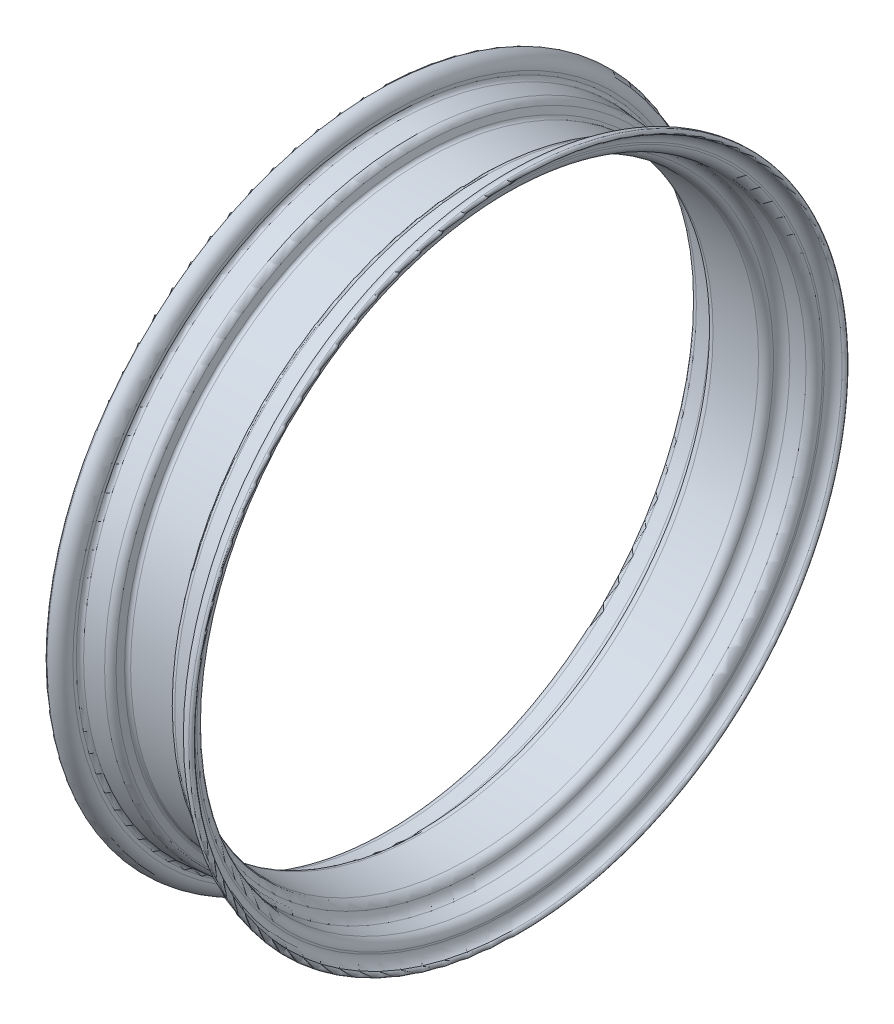
ISO-10303-21;
HEADER;
FILE_DESCRIPTION(('STEP AP214'),'2;1');
FILE_NAME('part.step','',(''),(''),'','','');
FILE_SCHEMA(('AUTOMOTIVE_DESIGN { 1 0 10303 214 1 1 1 1 }'));
ENDSEC;
DATA;
#1=APPLICATION_CONTEXT('core data for automotive mechanical design processes');
#2=APPLICATION_PROTOCOL_DEFINITION('international standard','automotive_design',2000,#1);
#3=PRODUCT_CONTEXT('',#1,'mechanical');
#4=PRODUCT('Part','Part','',(#3));
#5=PRODUCT_RELATED_PRODUCT_CATEGORY('part','',(#4));
#6=PRODUCT_DEFINITION_FORMATION('','',#4);
#7=PRODUCT_DEFINITION_CONTEXT('part definition',#1,'design');
#8=PRODUCT_DEFINITION('design','',#6,#7);
#9=PRODUCT_DEFINITION_SHAPE('','',#8);
#10=(LENGTH_UNIT() NAMED_UNIT(*) SI_UNIT(.MILLI.,.METRE.));
#11=(NAMED_UNIT(*) PLANE_ANGLE_UNIT() SI_UNIT($,.RADIAN.));
#12=(NAMED_UNIT(*) SI_UNIT($,.STERADIAN.) SOLID_ANGLE_UNIT());
#13=UNCERTAINTY_MEASURE_WITH_UNIT(LENGTH_MEASURE(1.E-05),#10,'distance_accuracy_value','');
#14=(GEOMETRIC_REPRESENTATION_CONTEXT(3) GLOBAL_UNCERTAINTY_ASSIGNED_CONTEXT((#13)) GLOBAL_UNIT_ASSIGNED_CONTEXT((#10,
#11,#12)) REPRESENTATION_CONTEXT('',''));
#15=CARTESIAN_POINT('',(0.,0.,0.));
#16=DIRECTION('',(0.,0.,1.));
#17=DIRECTION('',(1.,0.,0.));
#18=AXIS2_PLACEMENT_3D('',#15,#16,#17);
#19=CARTESIAN_POINT('',(-46.4999999999998,0.,0.));
#20=DIRECTION('',(-1.,0.,0.));
#21=DIRECTION('',(0.,0.,1.));
#22=AXIS2_PLACEMENT_3D('',#19,#20,#21);
#23=TOROIDAL_SURFACE('',#22,207.588294139001,8.49999999999985);
#24=CARTESIAN_POINT('',(-46.4999999999998,0.,0.));
#25=DIRECTION('',(-1.,0.,0.));
#26=DIRECTION('',(0.,0.,1.));
#27=AXIS2_PLACEMENT_3D('',#24,#25,#26);
#28=CIRCLE('',#27,216.088294139001);
#29=CARTESIAN_POINT('',(-46.4999999999998,0.,216.088294139001));
#30=VERTEX_POINT('',#29);
#31=EDGE_CURVE('E10',#30,#30,#28,.T.);
#32=ORIENTED_EDGE('',*,*,#31,.F.);
#33=EDGE_LOOP('',(#32));
#34=FACE_BOUND('',#33,.T.);
#35=CARTESIAN_POINT('',(-38.0000000000001,0.,0.));
#36=DIRECTION('',(-1.,0.,0.));
#37=DIRECTION('',(0.,0.,1.));
#38=AXIS2_PLACEMENT_3D('',#35,#36,#37);
#39=CIRCLE('',#38,207.588294139001);
#40=CARTESIAN_POINT('',(-38.0000000000001,0.,207.588294139001));
#41=VERTEX_POINT('',#40);
#42=EDGE_CURVE('E128',#41,#41,#39,.T.);
#43=ORIENTED_EDGE('',*,*,#42,.T.);
#44=EDGE_LOOP('',(#43));
#45=FACE_BOUND('',#44,.T.);
#46=ADVANCED_FACE('F34',(#34,#45),#23,.T.);
#47=CARTESIAN_POINT('',(-46.5000000000002,0.,0.));
#48=DIRECTION('',(-1.,0.,0.));
#49=DIRECTION('',(0.,0.,1.));
#50=AXIS2_PLACEMENT_3D('',#47,#48,#49);
#51=TOROIDAL_SURFACE('',#50,214.500794139001,1.58749999999996);
#52=CARTESIAN_POINT('',(-46.4999999999998,0.,0.));
#53=DIRECTION('',(-1.,0.,0.));
#54=DIRECTION('',(0.,0.,1.));
#55=AXIS2_PLACEMENT_3D('',#52,#53,#54);
#56=CIRCLE('',#55,212.913294139001);
#57=CARTESIAN_POINT('',(-46.4999999999998,0.,212.913294139001));
#58=VERTEX_POINT('',#57);
#59=EDGE_CURVE('E40',#58,#58,#56,.T.);
#60=ORIENTED_EDGE('',*,*,#59,.F.);
#61=EDGE_LOOP('',(#60));
#62=FACE_BOUND('',#61,.T.);
#63=ORIENTED_EDGE('',*,*,#31,.T.);
#64=EDGE_LOOP('',(#63));
#65=FACE_BOUND('',#64,.T.);
#66=ADVANCED_FACE('F297',(#62,#65),#51,.T.);
#67=CARTESIAN_POINT('',(-47.5664774784038,0.,0.));
#68=DIRECTION('',(-1.,0.,0.));
#69=DIRECTION('',(0.,0.,1.));
#70=AXIS2_PLACEMENT_3D('',#67,#68,#69);
#71=TOROIDAL_SURFACE('',#70,206.602777061292,6.4);
#72=CARTESIAN_POINT('',(-41.1664774784038,0.,0.));
#73=DIRECTION('',(-1.,0.,0.));
#74=DIRECTION('',(0.,0.,1.));
#75=AXIS2_PLACEMENT_3D('',#72,#73,#74);
#76=CIRCLE('',#75,206.602777061292);
#77=CARTESIAN_POINT('',(-41.1664774784038,0.,206.602777061292));
#78=VERTEX_POINT('',#77);
#79=EDGE_CURVE('E44',#78,#78,#76,.T.);
#80=ORIENTED_EDGE('',*,*,#79,.F.);
#81=EDGE_LOOP('',(#80));
#82=FACE_BOUND('',#81,.T.);
#83=ORIENTED_EDGE('',*,*,#59,.T.);
#84=EDGE_LOOP('',(#83));
#85=FACE_BOUND('',#84,.T.);
#86=ADVANCED_FACE('F292',(#82,#85),#71,.F.);
#87=CARTESIAN_POINT('',(-41.1664774784039,205.408377222496,0.));
#88=DIRECTION('',(1.,0.,0.));
#89=DIRECTION('',(0.,0.,-1.));
#90=AXIS2_PLACEMENT_3D('',#87,#88,#89);
#91=PLANE('',#90);
#92=CARTESIAN_POINT('',(-41.166477478404,0.,0.));
#93=DIRECTION('',(-1.,0.,0.));
#94=DIRECTION('',(0.,0.,1.));
#95=AXIS2_PLACEMENT_3D('',#92,#93,#94);
#96=CIRCLE('',#95,205.408377222496);
#97=CARTESIAN_POINT('',(-41.166477478404,0.,205.408377222496));
#98=VERTEX_POINT('',#97);
#99=EDGE_CURVE('E48',#98,#98,#96,.T.);
#100=ORIENTED_EDGE('',*,*,#99,.F.);
#101=EDGE_LOOP('',(#100));
#102=FACE_BOUND('',#101,.T.);
#103=ORIENTED_EDGE('',*,*,#79,.T.);
#104=EDGE_LOOP('',(#103));
#105=FACE_BOUND('',#104,.T.);
#106=ADVANCED_FACE('F286',(#102,#105),#91,.F.);
#107=CARTESIAN_POINT('',(-35.4797633166288,0.,0.));
#108=DIRECTION('',(-1.,0.,0.));
#109=DIRECTION('',(0.,0.,1.));
#110=AXIS2_PLACEMENT_3D('',#107,#108,#109);
#111=TOROIDAL_SURFACE('',#110,205.408377222496,5.68671416177523);
#112=CARTESIAN_POINT('',(-35.9753931131919,0.,0.));
#113=DIRECTION('',(-1.,0.,0.));
#114=DIRECTION('',(0.,0.,1.));
#115=AXIS2_PLACEMENT_3D('',#112,#113,#114);
#116=CIRCLE('',#115,199.743302724972);
#117=CARTESIAN_POINT('',(-35.9753931131919,0.,199.743302724972));
#118=VERTEX_POINT('',#117);
#119=EDGE_CURVE('E53',#118,#118,#116,.T.);
#120=ORIENTED_EDGE('',*,*,#119,.F.);
#121=EDGE_LOOP('',(#120));
#122=FACE_BOUND('',#121,.T.);
#123=ORIENTED_EDGE('',*,*,#99,.T.);
#124=EDGE_LOOP('',(#123));
#125=FACE_BOUND('',#124,.T.);
#126=ADVANCED_FACE('F280',(#122,#125),#111,.T.);
#127=CARTESIAN_POINT('',(-35.9753931131919,0.,0.));
#128=DIRECTION('',(-1.,0.,0.));
#129=DIRECTION('',(0.,0.,1.));
#130=AXIS2_PLACEMENT_3D('',#127,#128,#129);
#131=CONICAL_SURFACE('',#130,199.743302724972,0.0872664625997016);
#132=CARTESIAN_POINT('',(-26.1935720396754,0.,0.));
#133=DIRECTION('',(-1.,0.,0.));
#134=DIRECTION('',(0.,0.,1.));
#135=AXIS2_PLACEMENT_3D('',#132,#133,#134);
#136=CIRCLE('',#135,198.887504272401);
#137=CARTESIAN_POINT('',(-26.1935720396754,0.,198.887504272401));
#138=VERTEX_POINT('',#137);
#139=EDGE_CURVE('E56',#138,#138,#136,.T.);
#140=ORIENTED_EDGE('',*,*,#139,.F.);
#141=EDGE_LOOP('',(#140));
#142=FACE_BOUND('',#141,.T.);
#143=ORIENTED_EDGE('',*,*,#119,.T.);
#144=EDGE_LOOP('',(#143));
#145=FACE_BOUND('',#144,.T.);
#146=ADVANCED_FACE('F274',(#142,#145),#131,.F.);
#147=CARTESIAN_POINT('',(-26.7600843675352,0.,0.));
#148=DIRECTION('',(-1.,0.,0.));
#149=DIRECTION('',(0.,0.,1.));
#150=AXIS2_PLACEMENT_3D('',#147,#148,#149);
#151=TOROIDAL_SURFACE('',#150,192.412238734804,6.49999999999996);
#152=CARTESIAN_POINT('',(-20.4442449637123,0.,0.));
#153=DIRECTION('',(-1.,0.,0.));
#154=DIRECTION('',(0.,0.,1.));
#155=AXIS2_PLACEMENT_3D('',#152,#153,#154);
#156=CIRCLE('',#155,193.948524068042);
#157=CARTESIAN_POINT('',(-20.4442449637123,0.,193.948524068042));
#158=VERTEX_POINT('',#157);
#159=EDGE_CURVE('E59',#158,#158,#156,.T.);
#160=ORIENTED_EDGE('',*,*,#159,.F.);
#161=EDGE_LOOP('',(#160));
#162=FACE_BOUND('',#161,.T.);
#163=ORIENTED_EDGE('',*,*,#139,.T.);
#164=EDGE_LOOP('',(#163));
#165=FACE_BOUND('',#164,.T.);
#166=ADVANCED_FACE('F268',(#162,#165),#151,.F.);
#167=CARTESIAN_POINT('',(-14.9300313303746,0.,0.));
#168=DIRECTION('',(-1.,0.,0.));
#169=DIRECTION('',(0.,0.,1.));
#170=AXIS2_PLACEMENT_3D('',#167,#168,#169);
#171=TOROIDAL_SURFACE('',#170,195.289819339754,5.67500000000028);
#172=CARTESIAN_POINT('',(-14.9300313303755,0.,0.));
#173=DIRECTION('',(-1.,0.,0.));
#174=DIRECTION('',(0.,0.,1.));
#175=AXIS2_PLACEMENT_3D('',#172,#173,#174);
#176=CIRCLE('',#175,189.614819339754);
#177=CARTESIAN_POINT('',(-14.9300313303755,0.,189.614819339754));
#178=VERTEX_POINT('',#177);
#179=EDGE_CURVE('E62',#178,#178,#176,.T.);
#180=ORIENTED_EDGE('',*,*,#179,.F.);
#181=EDGE_LOOP('',(#180));
#182=FACE_BOUND('',#181,.T.);
#183=ORIENTED_EDGE('',*,*,#159,.T.);
#184=EDGE_LOOP('',(#183));
#185=FACE_BOUND('',#184,.T.);
#186=ADVANCED_FACE('F262',(#182,#185),#171,.T.);
#187=CARTESIAN_POINT('',(-85.5091699941872,0.,0.));
#188=DIRECTION('',(-1.,0.,0.));
#189=DIRECTION('',(0.,0.,1.));
#190=AXIS2_PLACEMENT_3D('',#187,#188,#189);
#191=CYLINDRICAL_SURFACE('',#190,189.614819339754);
#192=CARTESIAN_POINT('',(14.9300313303753,0.,0.));
#193=DIRECTION('',(-1.,0.,0.));
#194=DIRECTION('',(0.,0.,1.));
#195=AXIS2_PLACEMENT_3D('',#192,#193,#194);
#196=CIRCLE('',#195,189.614819339754);
#197=CARTESIAN_POINT('',(14.9300313303753,0.,189.614819339754));
#198=VERTEX_POINT('',#197);
#199=EDGE_CURVE('E65',#198,#198,#196,.T.);
#200=ORIENTED_EDGE('',*,*,#199,.F.);
#201=EDGE_LOOP('',(#200));
#202=FACE_BOUND('',#201,.T.);
#203=ORIENTED_EDGE('',*,*,#179,.T.);
#204=EDGE_LOOP('',(#203));
#205=FACE_BOUND('',#204,.T.);
#206=ADVANCED_FACE('F256',(#202,#205),#191,.F.);
#207=CARTESIAN_POINT('',(14.9300313303752,0.,0.));
#208=DIRECTION('',(-1.,0.,0.));
#209=DIRECTION('',(0.,0.,1.));
#210=AXIS2_PLACEMENT_3D('',#207,#208,#209);
#211=TOROIDAL_SURFACE('',#210,195.289819339754,5.67500000000001);
#212=CARTESIAN_POINT('',(20.4442449637126,0.,0.));
#213=DIRECTION('',(-1.,0.,0.));
#214=DIRECTION('',(0.,0.,1.));
#215=AXIS2_PLACEMENT_3D('',#212,#213,#214);
#216=CIRCLE('',#215,193.948524068042);
#217=CARTESIAN_POINT('',(20.4442449637126,0.,193.948524068042));
#218=VERTEX_POINT('',#217);
#219=EDGE_CURVE('E68',#218,#218,#216,.T.);
#220=ORIENTED_EDGE('',*,*,#219,.F.);
#221=EDGE_LOOP('',(#220));
#222=FACE_BOUND('',#221,.T.);
#223=ORIENTED_EDGE('',*,*,#199,.T.);
#224=EDGE_LOOP('',(#223));
#225=FACE_BOUND('',#224,.T.);
#226=ADVANCED_FACE('F250',(#222,#225),#211,.T.);
#227=CARTESIAN_POINT('',(26.7600843675352,0.,0.));
#228=DIRECTION('',(-1.,0.,0.));
#229=DIRECTION('',(0.,0.,1.));
#230=AXIS2_PLACEMENT_3D('',#227,#228,#229);
#231=TOROIDAL_SURFACE('',#230,192.412238734804,6.49999999999999);
#232=CARTESIAN_POINT('',(26.1935720396755,0.,0.));
#233=DIRECTION('',(-1.,0.,0.));
#234=DIRECTION('',(0.,0.,1.));
#235=AXIS2_PLACEMENT_3D('',#232,#233,#234);
#236=CIRCLE('',#235,198.887504272401);
#237=CARTESIAN_POINT('',(26.1935720396755,0.,198.887504272401));
#238=VERTEX_POINT('',#237);
#239=EDGE_CURVE('E71',#238,#238,#236,.T.);
#240=ORIENTED_EDGE('',*,*,#239,.F.);
#241=EDGE_LOOP('',(#240));
#242=FACE_BOUND('',#241,.T.);
#243=ORIENTED_EDGE('',*,*,#219,.T.);
#244=EDGE_LOOP('',(#243));
#245=FACE_BOUND('',#244,.T.);
#246=ADVANCED_FACE('F244',(#242,#245),#231,.F.);
#247=CARTESIAN_POINT('',(26.1935720396755,0.,0.));
#248=DIRECTION('',(1.,0.,0.));
#249=DIRECTION('',(0.,0.,-1.));
#250=AXIS2_PLACEMENT_3D('',#247,#248,#249);
#251=CONICAL_SURFACE('',#250,198.887504272401,0.087266462599705);
#252=CARTESIAN_POINT('',(35.9753931131919,0.,0.));
#253=DIRECTION('',(-1.,0.,0.));
#254=DIRECTION('',(0.,0.,1.));
#255=AXIS2_PLACEMENT_3D('',#252,#253,#254);
#256=CIRCLE('',#255,199.743302724972);
#257=CARTESIAN_POINT('',(35.9753931131919,0.,199.743302724972));
#258=VERTEX_POINT('',#257);
#259=EDGE_CURVE('E74',#258,#258,#256,.T.);
#260=ORIENTED_EDGE('',*,*,#259,.F.);
#261=EDGE_LOOP('',(#260));
#262=FACE_BOUND('',#261,.T.);
#263=ORIENTED_EDGE('',*,*,#239,.T.);
#264=EDGE_LOOP('',(#263));
#265=FACE_BOUND('',#264,.T.);
#266=ADVANCED_FACE('F238',(#262,#265),#251,.F.);
#267=CARTESIAN_POINT('',(35.4797633166288,0.,0.));
#268=DIRECTION('',(-1.,0.,0.));
#269=DIRECTION('',(0.,0.,1.));
#270=AXIS2_PLACEMENT_3D('',#267,#268,#269);
#271=TOROIDAL_SURFACE('',#270,205.408377222496,5.68671416177506);
#272=CARTESIAN_POINT('',(41.1664774784038,0.,0.));
#273=DIRECTION('',(-1.,0.,0.));
#274=DIRECTION('',(0.,0.,1.));
#275=AXIS2_PLACEMENT_3D('',#272,#273,#274);
#276=CIRCLE('',#275,205.408377222496);
#277=CARTESIAN_POINT('',(41.1664774784038,0.,205.408377222496));
#278=VERTEX_POINT('',#277);
#279=EDGE_CURVE('E77',#278,#278,#276,.T.);
#280=ORIENTED_EDGE('',*,*,#279,.F.);
#281=EDGE_LOOP('',(#280));
#282=FACE_BOUND('',#281,.T.);
#283=ORIENTED_EDGE('',*,*,#259,.T.);
#284=EDGE_LOOP('',(#283));
#285=FACE_BOUND('',#284,.T.);
#286=ADVANCED_FACE('F232',(#282,#285),#271,.T.);
#287=CARTESIAN_POINT('',(41.1664774784038,205.408377222496,0.));
#288=DIRECTION('',(-1.,0.,0.));
#289=DIRECTION('',(0.,0.,1.));
#290=AXIS2_PLACEMENT_3D('',#287,#288,#289);
#291=PLANE('',#290);
#292=CARTESIAN_POINT('',(41.1664774784038,0.,0.));
#293=DIRECTION('',(-1.,0.,0.));
#294=DIRECTION('',(0.,0.,1.));
#295=AXIS2_PLACEMENT_3D('',#292,#293,#294);
#296=CIRCLE('',#295,206.602777061292);
#297=CARTESIAN_POINT('',(41.1664774784038,0.,206.602777061292));
#298=VERTEX_POINT('',#297);
#299=EDGE_CURVE('E80',#298,#298,#296,.T.);
#300=ORIENTED_EDGE('',*,*,#299,.F.);
#301=EDGE_LOOP('',(#300));
#302=FACE_BOUND('',#301,.T.);
#303=ORIENTED_EDGE('',*,*,#279,.T.);
#304=EDGE_LOOP('',(#303));
#305=FACE_BOUND('',#304,.T.);
#306=ADVANCED_FACE('F226',(#302,#305),#291,.F.);
#307=CARTESIAN_POINT('',(47.5664774784038,0.,0.));
#308=DIRECTION('',(-1.,0.,0.));
#309=DIRECTION('',(0.,0.,1.));
#310=AXIS2_PLACEMENT_3D('',#307,#308,#309);
#311=TOROIDAL_SURFACE('',#310,206.602777061292,6.4);
#312=CARTESIAN_POINT('',(46.4999999999998,0.,0.));
#313=DIRECTION('',(-1.,0.,0.));
#314=DIRECTION('',(0.,0.,1.));
#315=AXIS2_PLACEMENT_3D('',#312,#313,#314);
#316=CIRCLE('',#315,212.913294139001);
#317=CARTESIAN_POINT('',(46.4999999999998,0.,212.913294139001));
#318=VERTEX_POINT('',#317);
#319=EDGE_CURVE('E83',#318,#318,#316,.T.);
#320=ORIENTED_EDGE('',*,*,#319,.F.);
#321=EDGE_LOOP('',(#320));
#322=FACE_BOUND('',#321,.T.);
#323=ORIENTED_EDGE('',*,*,#299,.T.);
#324=EDGE_LOOP('',(#323));
#325=FACE_BOUND('',#324,.T.);
#326=ADVANCED_FACE('F220',(#322,#325),#311,.F.);
#327=CARTESIAN_POINT('',(46.5000000000002,0.,0.));
#328=DIRECTION('',(-1.,0.,0.));
#329=DIRECTION('',(0.,0.,1.));
#330=AXIS2_PLACEMENT_3D('',#327,#328,#329);
#331=TOROIDAL_SURFACE('',#330,214.500794139001,1.58749999999994);
#332=CARTESIAN_POINT('',(46.4999999999998,0.,0.));
#333=DIRECTION('',(-1.,0.,0.));
#334=DIRECTION('',(0.,0.,1.));
#335=AXIS2_PLACEMENT_3D('',#332,#333,#334);
#336=CIRCLE('',#335,216.088294139001);
#337=CARTESIAN_POINT('',(46.4999999999998,0.,216.088294139001));
#338=VERTEX_POINT('',#337);
#339=EDGE_CURVE('E86',#338,#338,#336,.T.);
#340=ORIENTED_EDGE('',*,*,#339,.F.);
#341=EDGE_LOOP('',(#340));
#342=FACE_BOUND('',#341,.T.);
#343=ORIENTED_EDGE('',*,*,#319,.T.);
#344=EDGE_LOOP('',(#343));
#345=FACE_BOUND('',#344,.T.);
#346=ADVANCED_FACE('F214',(#342,#345),#331,.T.);
#347=CARTESIAN_POINT('',(46.4999999999998,0.,0.));
#348=DIRECTION('',(-1.,0.,0.));
#349=DIRECTION('',(0.,0.,1.));
#350=AXIS2_PLACEMENT_3D('',#347,#348,#349);
#351=TOROIDAL_SURFACE('',#350,207.588294139001,8.49999999999978);
#352=CARTESIAN_POINT('',(38.0000000000002,0.,0.));
#353=DIRECTION('',(-1.,0.,0.));
#354=DIRECTION('',(0.,0.,1.));
#355=AXIS2_PLACEMENT_3D('',#352,#353,#354);
#356=CIRCLE('',#355,207.588294139001);
#357=CARTESIAN_POINT('',(38.0000000000002,0.,207.588294139001));
#358=VERTEX_POINT('',#357);
#359=EDGE_CURVE('E89',#358,#358,#356,.T.);
#360=ORIENTED_EDGE('',*,*,#359,.F.);
#361=EDGE_LOOP('',(#360));
#362=FACE_BOUND('',#361,.T.);
#363=ORIENTED_EDGE('',*,*,#339,.T.);
#364=EDGE_LOOP('',(#363));
#365=FACE_BOUND('',#364,.T.);
#366=ADVANCED_FACE('F208',(#362,#365),#351,.T.);
#367=CARTESIAN_POINT('',(38.0000000000001,205.390486745229,0.));
#368=DIRECTION('',(1.,0.,0.));
#369=DIRECTION('',(0.,0.,-1.));
#370=AXIS2_PLACEMENT_3D('',#367,#368,#369);
#371=PLANE('',#370);
#372=CARTESIAN_POINT('',(38.,0.,0.));
#373=DIRECTION('',(-1.,0.,0.));
#374=DIRECTION('',(0.,0.,1.));
#375=AXIS2_PLACEMENT_3D('',#372,#373,#374);
#376=CIRCLE('',#375,205.390486745229);
#377=CARTESIAN_POINT('',(38.,0.,205.390486745229));
#378=VERTEX_POINT('',#377);
#379=EDGE_CURVE('E92',#378,#378,#376,.T.);
#380=ORIENTED_EDGE('',*,*,#379,.F.);
#381=EDGE_LOOP('',(#380));
#382=FACE_BOUND('',#381,.T.);
#383=ORIENTED_EDGE('',*,*,#359,.T.);
#384=EDGE_LOOP('',(#383));
#385=FACE_BOUND('',#384,.T.);
#386=ADVANCED_FACE('F202',(#382,#385),#371,.F.);
#387=CARTESIAN_POINT('',(35.5,0.,0.));
#388=DIRECTION('',(-1.,0.,0.));
#389=DIRECTION('',(0.,0.,1.));
#390=AXIS2_PLACEMENT_3D('',#387,#388,#389);
#391=TOROIDAL_SURFACE('',#390,205.390486745229,2.5);
#392=CARTESIAN_POINT('',(35.7178893568692,0.,0.));
#393=DIRECTION('',(-1.,0.,0.));
#394=DIRECTION('',(0.,0.,1.));
#395=AXIS2_PLACEMENT_3D('',#392,#393,#394);
#396=CIRCLE('',#395,202.9);
#397=CARTESIAN_POINT('',(35.7178893568692,0.,202.9));
#398=VERTEX_POINT('',#397);
#399=EDGE_CURVE('E95',#398,#398,#396,.T.);
#400=ORIENTED_EDGE('',*,*,#399,.F.);
#401=EDGE_LOOP('',(#400));
#402=FACE_BOUND('',#401,.T.);
#403=ORIENTED_EDGE('',*,*,#379,.T.);
#404=EDGE_LOOP('',(#403));
#405=FACE_BOUND('',#404,.T.);
#406=ADVANCED_FACE('F196',(#402,#405),#391,.F.);
#407=CARTESIAN_POINT('',(35.7178893568692,0.,0.));
#408=DIRECTION('',(1.,0.,0.));
#409=DIRECTION('',(0.,0.,-1.));
#410=AXIS2_PLACEMENT_3D('',#407,#408,#409);
#411=CONICAL_SURFACE('',#410,202.9,0.0872664625997016);
#412=CARTESIAN_POINT('',(23.0284663447406,0.,0.));
#413=DIRECTION('',(-1.,0.,0.));
#414=DIRECTION('',(0.,0.,1.));
#415=AXIS2_PLACEMENT_3D('',#412,#413,#414);
#416=CIRCLE('',#415,201.789819339754);
#417=CARTESIAN_POINT('',(23.0284663447406,0.,201.789819339754));
#418=VERTEX_POINT('',#417);
#419=EDGE_CURVE('E98',#418,#418,#416,.T.);
#420=ORIENTED_EDGE('',*,*,#419,.F.);
#421=EDGE_LOOP('',(#420));
#422=FACE_BOUND('',#421,.T.);
#423=ORIENTED_EDGE('',*,*,#399,.T.);
#424=EDGE_LOOP('',(#423));
#425=FACE_BOUND('',#424,.T.);
#426=ADVANCED_FACE('F190',(#422,#425),#411,.T.);
#427=CARTESIAN_POINT('',(23.4642450584789,0.,0.));
#428=DIRECTION('',(-1.,0.,0.));
#429=DIRECTION('',(0.,0.,1.));
#430=AXIS2_PLACEMENT_3D('',#427,#428,#429);
#431=TOROIDAL_SURFACE('',#430,196.808845849295,5.00000000000003);
#432=CARTESIAN_POINT('',(18.7657819545493,0.,0.));
#433=DIRECTION('',(-1.,0.,0.));
#434=DIRECTION('',(0.,0.,1.));
#435=AXIS2_PLACEMENT_3D('',#432,#433,#434);
#436=CIRCLE('',#435,198.518946565923);
#437=CARTESIAN_POINT('',(18.7657819545493,0.,198.518946565923));
#438=VERTEX_POINT('',#437);
#439=EDGE_CURVE('E101',#438,#438,#436,.T.);
#440=ORIENTED_EDGE('',*,*,#439,.F.);
#441=EDGE_LOOP('',(#440));
#442=FACE_BOUND('',#441,.T.);
#443=ORIENTED_EDGE('',*,*,#419,.T.);
#444=EDGE_LOOP('',(#443));
#445=FACE_BOUND('',#444,.T.);
#446=ADVANCED_FACE('F184',(#442,#445),#431,.T.);
#447=CARTESIAN_POINT('',(18.7657819545493,0.,0.));
#448=DIRECTION('',(1.,0.,0.));
#449=DIRECTION('',(0.,0.,-1.));
#450=AXIS2_PLACEMENT_3D('',#447,#448,#449);
#451=CONICAL_SURFACE('',#450,198.518946565923,1.22173047639603);
#452=CARTESIAN_POINT('',(17.27926288234,0.,0.));
#453=DIRECTION('',(-1.,0.,0.));
#454=DIRECTION('',(0.,0.,1.));
#455=AXIS2_PLACEMENT_3D('',#452,#453,#454);
#456=CIRCLE('',#455,194.43476898144);
#457=CARTESIAN_POINT('',(17.27926288234,0.,194.43476898144));
#458=VERTEX_POINT('',#457);
#459=EDGE_CURVE('E104',#458,#458,#456,.T.);
#460=ORIENTED_EDGE('',*,*,#459,.F.);
#461=EDGE_LOOP('',(#460));
#462=FACE_BOUND('',#461,.T.);
#463=ORIENTED_EDGE('',*,*,#439,.T.);
#464=EDGE_LOOP('',(#463));
#465=FACE_BOUND('',#464,.T.);
#466=ADVANCED_FACE('F178',(#462,#465),#451,.T.);
#467=CARTESIAN_POINT('',(14.9300313303752,0.,0.));
#468=DIRECTION('',(-1.,0.,0.));
#469=DIRECTION('',(0.,0.,1.));
#470=AXIS2_PLACEMENT_3D('',#467,#468,#469);
#471=TOROIDAL_SURFACE('',#470,195.289819339754,2.50000000000001);
#472=CARTESIAN_POINT('',(14.9300313303752,0.,0.));
#473=DIRECTION('',(-1.,0.,0.));
#474=DIRECTION('',(0.,0.,1.));
#475=AXIS2_PLACEMENT_3D('',#472,#473,#474);
#476=CIRCLE('',#475,192.789819339754);
#477=CARTESIAN_POINT('',(14.9300313303752,0.,192.789819339754));
#478=VERTEX_POINT('',#477);
#479=EDGE_CURVE('E107',#478,#478,#476,.T.);
#480=ORIENTED_EDGE('',*,*,#479,.F.);
#481=EDGE_LOOP('',(#480));
#482=FACE_BOUND('',#481,.T.);
#483=ORIENTED_EDGE('',*,*,#459,.T.);
#484=EDGE_LOOP('',(#483));
#485=FACE_BOUND('',#484,.T.);
#486=ADVANCED_FACE('F172',(#482,#485),#471,.F.);
#487=CARTESIAN_POINT('',(-85.5091699941872,0.,0.));
#488=DIRECTION('',(-1.,0.,0.));
#489=DIRECTION('',(0.,0.,1.));
#490=AXIS2_PLACEMENT_3D('',#487,#488,#489);
#491=CYLINDRICAL_SURFACE('',#490,192.789819339754);
#492=CARTESIAN_POINT('',(-14.930031330375,0.,0.));
#493=DIRECTION('',(-1.,0.,0.));
#494=DIRECTION('',(0.,0.,1.));
#495=AXIS2_PLACEMENT_3D('',#492,#493,#494);
#496=CIRCLE('',#495,192.789819339754);
#497=CARTESIAN_POINT('',(-14.930031330375,0.,192.789819339754));
#498=VERTEX_POINT('',#497);
#499=EDGE_CURVE('E110',#498,#498,#496,.T.);
#500=ORIENTED_EDGE('',*,*,#499,.F.);
#501=EDGE_LOOP('',(#500));
#502=FACE_BOUND('',#501,.T.);
#503=ORIENTED_EDGE('',*,*,#479,.T.);
#504=EDGE_LOOP('',(#503));
#505=FACE_BOUND('',#504,.T.);
#506=ADVANCED_FACE('F166',(#502,#505),#491,.T.);
#507=CARTESIAN_POINT('',(-14.9300313303746,0.,0.));
#508=DIRECTION('',(-1.,0.,0.));
#509=DIRECTION('',(0.,0.,1.));
#510=AXIS2_PLACEMENT_3D('',#507,#508,#509);
#511=TOROIDAL_SURFACE('',#510,195.289819339754,2.50000000000037);
#512=CARTESIAN_POINT('',(-17.27926288234,0.,0.));
#513=DIRECTION('',(-1.,0.,0.));
#514=DIRECTION('',(0.,0.,1.));
#515=AXIS2_PLACEMENT_3D('',#512,#513,#514);
#516=CIRCLE('',#515,194.43476898144);
#517=CARTESIAN_POINT('',(-17.27926288234,0.,194.43476898144));
#518=VERTEX_POINT('',#517);
#519=EDGE_CURVE('E113',#518,#518,#516,.T.);
#520=ORIENTED_EDGE('',*,*,#519,.F.);
#521=EDGE_LOOP('',(#520));
#522=FACE_BOUND('',#521,.T.);
#523=ORIENTED_EDGE('',*,*,#499,.T.);
#524=EDGE_LOOP('',(#523));
#525=FACE_BOUND('',#524,.T.);
#526=ADVANCED_FACE('F160',(#522,#525),#511,.F.);
#527=CARTESIAN_POINT('',(-17.27926288234,0.,0.));
#528=DIRECTION('',(-1.,0.,0.));
#529=DIRECTION('',(0.,0.,1.));
#530=AXIS2_PLACEMENT_3D('',#527,#528,#529);
#531=CONICAL_SURFACE('',#530,194.43476898144,1.22173047639603);
#532=CARTESIAN_POINT('',(-18.7657819545495,0.,0.));
#533=DIRECTION('',(-1.,0.,0.));
#534=DIRECTION('',(0.,0.,1.));
#535=AXIS2_PLACEMENT_3D('',#532,#533,#534);
#536=CIRCLE('',#535,198.518946565924);
#537=CARTESIAN_POINT('',(-18.7657819545495,0.,198.518946565924));
#538=VERTEX_POINT('',#537);
#539=EDGE_CURVE('E116',#538,#538,#536,.T.);
#540=ORIENTED_EDGE('',*,*,#539,.F.);
#541=EDGE_LOOP('',(#540));
#542=FACE_BOUND('',#541,.T.);
#543=ORIENTED_EDGE('',*,*,#519,.T.);
#544=EDGE_LOOP('',(#543));
#545=FACE_BOUND('',#544,.T.);
#546=ADVANCED_FACE('F154',(#542,#545),#531,.T.);
#547=CARTESIAN_POINT('',(-23.4642450584789,0.,0.));
#548=DIRECTION('',(-1.,0.,0.));
#549=DIRECTION('',(0.,0.,1.));
#550=AXIS2_PLACEMENT_3D('',#547,#548,#549);
#551=TOROIDAL_SURFACE('',#550,196.808845849295,5.);
#552=CARTESIAN_POINT('',(-23.0284663447418,0.,0.));
#553=DIRECTION('',(-1.,0.,0.));
#554=DIRECTION('',(0.,0.,1.));
#555=AXIS2_PLACEMENT_3D('',#552,#553,#554);
#556=CIRCLE('',#555,201.789819339754);
#557=CARTESIAN_POINT('',(-23.0284663447418,0.,201.789819339754));
#558=VERTEX_POINT('',#557);
#559=EDGE_CURVE('E119',#558,#558,#556,.T.);
#560=ORIENTED_EDGE('',*,*,#559,.F.);
#561=EDGE_LOOP('',(#560));
#562=FACE_BOUND('',#561,.T.);
#563=ORIENTED_EDGE('',*,*,#539,.T.);
#564=EDGE_LOOP('',(#563));
#565=FACE_BOUND('',#564,.T.);
#566=ADVANCED_FACE('F148',(#562,#565),#551,.T.);
#567=CARTESIAN_POINT('',(-23.0284663447418,0.,0.));
#568=DIRECTION('',(-1.,0.,0.));
#569=DIRECTION('',(0.,0.,1.));
#570=AXIS2_PLACEMENT_3D('',#567,#568,#569);
#571=CONICAL_SURFACE('',#570,201.789819339754,0.0872664625996983);
#572=CARTESIAN_POINT('',(-35.7178893568693,0.,0.));
#573=DIRECTION('',(-1.,0.,0.));
#574=DIRECTION('',(0.,0.,1.));
#575=AXIS2_PLACEMENT_3D('',#572,#573,#574);
#576=CIRCLE('',#575,202.9);
#577=CARTESIAN_POINT('',(-35.7178893568693,0.,202.9));
#578=VERTEX_POINT('',#577);
#579=EDGE_CURVE('E122',#578,#578,#576,.T.);
#580=ORIENTED_EDGE('',*,*,#579,.F.);
#581=EDGE_LOOP('',(#580));
#582=FACE_BOUND('',#581,.T.);
#583=ORIENTED_EDGE('',*,*,#559,.T.);
#584=EDGE_LOOP('',(#583));
#585=FACE_BOUND('',#584,.T.);
#586=ADVANCED_FACE('F142',(#582,#585),#571,.T.);
#587=CARTESIAN_POINT('',(-35.5,0.,0.));
#588=DIRECTION('',(-1.,0.,0.));
#589=DIRECTION('',(0.,0.,1.));
#590=AXIS2_PLACEMENT_3D('',#587,#588,#589);
#591=TOROIDAL_SURFACE('',#590,205.390486745229,2.50000000000021);
#592=CARTESIAN_POINT('',(-38.0000000000003,0.,0.));
#593=DIRECTION('',(-1.,0.,0.));
#594=DIRECTION('',(0.,0.,1.));
#595=AXIS2_PLACEMENT_3D('',#592,#593,#594);
#596=CIRCLE('',#595,205.390486745229);
#597=CARTESIAN_POINT('',(-38.0000000000003,0.,205.390486745229));
#598=VERTEX_POINT('',#597);
#599=EDGE_CURVE('E125',#598,#598,#596,.T.);
#600=ORIENTED_EDGE('',*,*,#599,.F.);
#601=EDGE_LOOP('',(#600));
#602=FACE_BOUND('',#601,.T.);
#603=ORIENTED_EDGE('',*,*,#579,.T.);
#604=EDGE_LOOP('',(#603));
#605=FACE_BOUND('',#604,.T.);
#606=ADVANCED_FACE('F136',(#602,#605),#591,.F.);
#607=CARTESIAN_POINT('',(-38.0000000000002,205.390486745229,0.));
#608=DIRECTION('',(-1.,0.,0.));
#609=DIRECTION('',(0.,0.,1.));
#610=AXIS2_PLACEMENT_3D('',#607,#608,#609);
#611=PLANE('',#610);
#612=ORIENTED_EDGE('',*,*,#42,.F.);
#613=EDGE_LOOP('',(#612));
#614=FACE_BOUND('',#613,.T.);
#615=ORIENTED_EDGE('',*,*,#599,.T.);
#616=EDGE_LOOP('',(#615));
#617=FACE_BOUND('',#616,.T.);
#618=ADVANCED_FACE('F133',(#614,#617),#611,.F.);
#619=CLOSED_SHELL('',(#46,#66,#86,#106,#126,#146,#166,#186,#206,#226,#246,#266,#286,#306,#326,
#346,#366,#386,#406,#426,#446,#466,#486,#506,#526,#546,#566,#586,#606,#618));
#620=MANIFOLD_SOLID_BREP('B2',#619);
#621=ADVANCED_BREP_SHAPE_REPRESENTATION('',(#18,#620),#14);
#622=SHAPE_DEFINITION_REPRESENTATION(#9,#621);
ENDSEC;
END-ISO-10303-21;
